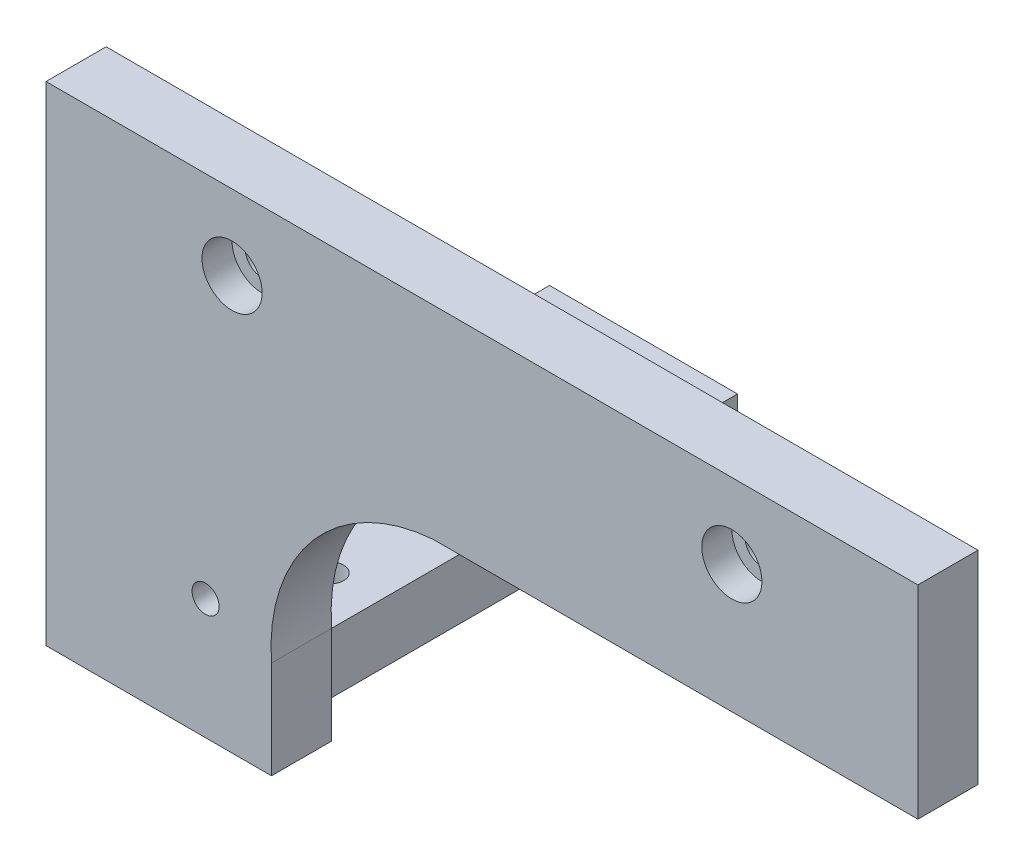
ISO-10303-21;
HEADER;
FILE_DESCRIPTION(('STEP AP214'),'2;1');
FILE_NAME('part.step','',(''),(''),'','','');
FILE_SCHEMA(('AUTOMOTIVE_DESIGN { 1 0 10303 214 1 1 1 1 }'));
ENDSEC;
DATA;
#1=APPLICATION_CONTEXT('core data for automotive mechanical design processes');
#2=APPLICATION_PROTOCOL_DEFINITION('international standard','automotive_design',2000,#1);
#3=PRODUCT_CONTEXT('',#1,'mechanical');
#4=PRODUCT('Part','Part','',(#3));
#5=PRODUCT_RELATED_PRODUCT_CATEGORY('part','',(#4));
#6=PRODUCT_DEFINITION_FORMATION('','',#4);
#7=PRODUCT_DEFINITION_CONTEXT('part definition',#1,'design');
#8=PRODUCT_DEFINITION('design','',#6,#7);
#9=PRODUCT_DEFINITION_SHAPE('','',#8);
#10=(LENGTH_UNIT() NAMED_UNIT(*) SI_UNIT(.MILLI.,.METRE.));
#11=(NAMED_UNIT(*) PLANE_ANGLE_UNIT() SI_UNIT($,.RADIAN.));
#12=(NAMED_UNIT(*) SI_UNIT($,.STERADIAN.) SOLID_ANGLE_UNIT());
#13=UNCERTAINTY_MEASURE_WITH_UNIT(LENGTH_MEASURE(1.E-05),#10,'distance_accuracy_value','');
#14=(GEOMETRIC_REPRESENTATION_CONTEXT(3) GLOBAL_UNCERTAINTY_ASSIGNED_CONTEXT((#13)) GLOBAL_UNIT_ASSIGNED_CONTEXT((#10,
#11,#12)) REPRESENTATION_CONTEXT('',''));
#15=CARTESIAN_POINT('',(0.,0.,0.));
#16=DIRECTION('',(0.,0.,1.));
#17=DIRECTION('',(1.,0.,0.));
#18=AXIS2_PLACEMENT_3D('',#15,#16,#17);
#19=CARTESIAN_POINT('',(33.25,3.5,0.));
#20=DIRECTION('',(0.,0.,1.));
#21=DIRECTION('',(1.,0.,0.));
#22=AXIS2_PLACEMENT_3D('',#19,#20,#21);
#23=CYLINDRICAL_SURFACE('',#22,2.25);
#24=CARTESIAN_POINT('',(33.25,3.5,0.));
#25=DIRECTION('',(0.,0.,1.));
#26=DIRECTION('',(1.,0.,0.));
#27=AXIS2_PLACEMENT_3D('',#24,#25,#26);
#28=CIRCLE('',#27,2.25);
#29=CARTESIAN_POINT('',(35.5,3.5,0.));
#30=VERTEX_POINT('',#29);
#31=EDGE_CURVE('E235',#30,#30,#28,.T.);
#32=ORIENTED_EDGE('',*,*,#31,.F.);
#33=EDGE_LOOP('',(#32));
#34=FACE_BOUND('',#33,.T.);
#35=CARTESIAN_POINT('',(33.25,3.5,4.));
#36=DIRECTION('',(0.,0.,1.));
#37=DIRECTION('',(1.,0.,0.));
#38=AXIS2_PLACEMENT_3D('',#35,#36,#37);
#39=CIRCLE('',#38,2.25);
#40=CARTESIAN_POINT('',(35.5,3.5,4.));
#41=VERTEX_POINT('',#40);
#42=EDGE_CURVE('E43',#41,#41,#39,.F.);
#43=ORIENTED_EDGE('',*,*,#42,.F.);
#44=EDGE_LOOP('',(#43));
#45=FACE_BOUND('',#44,.T.);
#46=ADVANCED_FACE('F39',(#34,#45),#23,.F.);
#47=CARTESIAN_POINT('',(-33.25,3.5,0.));
#48=DIRECTION('',(0.,0.,1.));
#49=DIRECTION('',(1.,0.,0.));
#50=AXIS2_PLACEMENT_3D('',#47,#48,#49);
#51=CYLINDRICAL_SURFACE('',#50,2.25);
#52=CARTESIAN_POINT('',(-33.25,3.5,0.));
#53=DIRECTION('',(0.,0.,1.));
#54=DIRECTION('',(1.,0.,0.));
#55=AXIS2_PLACEMENT_3D('',#52,#53,#54);
#56=CIRCLE('',#55,2.25);
#57=CARTESIAN_POINT('',(-31.,3.5,0.));
#58=VERTEX_POINT('',#57);
#59=EDGE_CURVE('E236',#58,#58,#56,.T.);
#60=ORIENTED_EDGE('',*,*,#59,.F.);
#61=EDGE_LOOP('',(#60));
#62=FACE_BOUND('',#61,.T.);
#63=CARTESIAN_POINT('',(-33.25,3.5,4.));
#64=DIRECTION('',(0.,0.,1.));
#65=DIRECTION('',(1.,0.,0.));
#66=AXIS2_PLACEMENT_3D('',#63,#64,#65);
#67=CIRCLE('',#66,2.25);
#68=CARTESIAN_POINT('',(-31.,3.5,4.));
#69=VERTEX_POINT('',#68);
#70=EDGE_CURVE('E160',#69,#69,#67,.F.);
#71=ORIENTED_EDGE('',*,*,#70,.F.);
#72=EDGE_LOOP('',(#71));
#73=FACE_BOUND('',#72,.T.);
#74=ADVANCED_FACE('F309',(#62,#73),#51,.F.);
#75=CARTESIAN_POINT('',(-58.,-43.5,8.));
#76=DIRECTION('',(0.,1.,0.));
#77=DIRECTION('',(0.,0.,1.));
#78=AXIS2_PLACEMENT_3D('',#75,#76,#77);
#79=PLANE('',#78);
#80=CARTESIAN_POINT('',(-28.244552345652,-43.5,-4.75544765434797));
#81=DIRECTION('',(0.,1.,0.));
#82=DIRECTION('',(0.,0.,-1.));
#83=AXIS2_PLACEMENT_3D('',#80,#81,#82);
#84=CIRCLE('',#83,4.76173164332131);
#85=CARTESIAN_POINT('',(-28.489104691304,-43.5,0.));
#86=VERTEX_POINT('',#85);
#87=CARTESIAN_POINT('',(-28.,-43.5,0.));
#88=VERTEX_POINT('',#87);
#89=EDGE_CURVE('E11',#86,#88,#84,.T.);
#90=ORIENTED_EDGE('',*,*,#89,.F.);
#91=DIRECTION('',(1.,0.,0.));
#92=VECTOR('',#91,1.);
#93=CARTESIAN_POINT('',(-58.,-43.5,0.));
#94=LINE('',#93,#92);
#95=EDGE_CURVE('E149',#86,#88,#94,.T.);
#96=ORIENTED_EDGE('',*,*,#95,.T.);
#97=EDGE_LOOP('',(#90,#96));
#98=FACE_BOUND('',#97,.T.);
#99=ADVANCED_FACE('F291',(#98),#79,.F.);
#100=CARTESIAN_POINT('',(-4.74999999999999,-36.75,8.));
#101=DIRECTION('',(0.,0.,1.));
#102=DIRECTION('',(1.,0.,0.));
#103=AXIS2_PLACEMENT_3D('',#100,#101,#102);
#104=PLANE('',#103);
#105=CARTESIAN_POINT('',(-33.25,3.5,8.));
#106=DIRECTION('',(0.,0.,1.));
#107=DIRECTION('',(1.,0.,0.));
#108=AXIS2_PLACEMENT_3D('',#105,#106,#107);
#109=CIRCLE('',#108,4.);
#110=CARTESIAN_POINT('',(-29.25,3.5,8.));
#111=VERTEX_POINT('',#110);
#112=EDGE_CURVE('E168',#111,#111,#109,.T.);
#113=ORIENTED_EDGE('',*,*,#112,.F.);
#114=EDGE_LOOP('',(#113));
#115=FACE_BOUND('',#114,.T.);
#116=CARTESIAN_POINT('',(33.25,3.5,8.));
#117=DIRECTION('',(0.,0.,1.));
#118=DIRECTION('',(1.,0.,0.));
#119=AXIS2_PLACEMENT_3D('',#116,#117,#118);
#120=CIRCLE('',#119,4.00000000000001);
#121=CARTESIAN_POINT('',(37.25,3.5,8.));
#122=VERTEX_POINT('',#121);
#123=EDGE_CURVE('E178',#122,#122,#120,.T.);
#124=ORIENTED_EDGE('',*,*,#123,.F.);
#125=EDGE_LOOP('',(#124));
#126=FACE_BOUND('',#125,.T.);
#127=DIRECTION('',(1.,0.,0.));
#128=VECTOR('',#127,1.);
#129=CARTESIAN_POINT('',(-6.50000000000001,-13.5,8.));
#130=LINE('',#129,#128);
#131=CARTESIAN_POINT('',(-6.5,-13.5,8.));
#132=VERTEX_POINT('',#131);
#133=CARTESIAN_POINT('',(58.,-13.5,8.));
#134=VERTEX_POINT('',#133);
#135=EDGE_CURVE('E156',#132,#134,#130,.T.);
#136=ORIENTED_EDGE('',*,*,#135,.T.);
#137=DIRECTION('',(0.,1.,0.));
#138=VECTOR('',#137,1.);
#139=CARTESIAN_POINT('',(58.,13.5,8.));
#140=LINE('',#139,#138);
#141=CARTESIAN_POINT('',(58.,13.5,8.));
#142=VERTEX_POINT('',#141);
#143=EDGE_CURVE('E99',#134,#142,#140,.T.);
#144=ORIENTED_EDGE('',*,*,#143,.T.);
#145=DIRECTION('',(-1.,0.,0.));
#146=VECTOR('',#145,1.);
#147=CARTESIAN_POINT('',(-58.,13.5,8.));
#148=LINE('',#147,#146);
#149=CARTESIAN_POINT('',(-58.,13.5,8.));
#150=VERTEX_POINT('',#149);
#151=EDGE_CURVE('E107',#142,#150,#148,.T.);
#152=ORIENTED_EDGE('',*,*,#151,.T.);
#153=DIRECTION('',(0.,-1.,0.));
#154=VECTOR('',#153,1.);
#155=CARTESIAN_POINT('',(-58.,13.5,8.));
#156=LINE('',#155,#154);
#157=CARTESIAN_POINT('',(-58.,-51.5,8.));
#158=VERTEX_POINT('',#157);
#159=EDGE_CURVE('E113',#150,#158,#156,.T.);
#160=ORIENTED_EDGE('',*,*,#159,.T.);
#161=DIRECTION('',(-1.,0.,0.));
#162=VECTOR('',#161,1.);
#163=CARTESIAN_POINT('',(-58.,-51.5,8.));
#164=LINE('',#163,#162);
#165=CARTESIAN_POINT('',(-28.,-51.5,8.));
#166=VERTEX_POINT('',#165);
#167=EDGE_CURVE('E212',#166,#158,#164,.T.);
#168=ORIENTED_EDGE('',*,*,#167,.F.);
#169=DIRECTION('',(0.,1.,0.));
#170=VECTOR('',#169,1.);
#171=CARTESIAN_POINT('',(-28.,-43.5,8.));
#172=LINE('',#171,#170);
#173=CARTESIAN_POINT('',(-28.,-38.5,8.));
#174=VERTEX_POINT('',#173);
#175=EDGE_CURVE('E133',#166,#174,#172,.T.);
#176=ORIENTED_EDGE('',*,*,#175,.T.);
#177=CARTESIAN_POINT('',(-4.74999999999999,-36.75,8.));
#178=DIRECTION('',(0.,0.,-1.));
#179=DIRECTION('',(1.,0.,0.));
#180=AXIS2_PLACEMENT_3D('',#177,#178,#179);
#181=CIRCLE('',#180,23.3157671973281);
#182=EDGE_CURVE('E63',#174,#132,#181,.T.);
#183=ORIENTED_EDGE('',*,*,#182,.T.);
#184=EDGE_LOOP('',(#136,#144,#152,#160,#168,#176,#183));
#185=FACE_BOUND('',#184,.T.);
#186=CARTESIAN_POINT('',(-36.7690984541548,-35.484363810152,8.));
#187=DIRECTION('',(0.,0.,1.));
#188=DIRECTION('',(1.,0.,0.));
#189=AXIS2_PLACEMENT_3D('',#186,#187,#188);
#190=CIRCLE('',#189,1.8);
#191=CARTESIAN_POINT('',(-34.9690984541548,-35.484363810152,8.));
#192=VERTEX_POINT('',#191);
#193=EDGE_CURVE('E144',#192,#192,#190,.T.);
#194=ORIENTED_EDGE('',*,*,#193,.F.);
#195=EDGE_LOOP('',(#194));
#196=FACE_BOUND('',#195,.T.);
#197=ADVANCED_FACE('F109',(#115,#126,#185,#196),#104,.T.);
#198=CARTESIAN_POINT('',(-4.74999999999999,-36.75,0.));
#199=DIRECTION('',(0.,0.,1.));
#200=DIRECTION('',(1.,0.,0.));
#201=AXIS2_PLACEMENT_3D('',#198,#199,#200);
#202=PLANE('',#201);
#203=ORIENTED_EDGE('',*,*,#59,.T.);
#204=EDGE_LOOP('',(#203));
#205=FACE_BOUND('',#204,.T.);
#206=ORIENTED_EDGE('',*,*,#31,.T.);
#207=EDGE_LOOP('',(#206));
#208=FACE_BOUND('',#207,.T.);
#209=DIRECTION('',(1.,0.,0.));
#210=VECTOR('',#209,1.);
#211=CARTESIAN_POINT('',(-6.50000000000001,-13.5,0.));
#212=LINE('',#211,#210);
#213=CARTESIAN_POINT('',(-6.5,-13.5,0.));
#214=VERTEX_POINT('',#213);
#215=CARTESIAN_POINT('',(58.,-13.5,0.));
#216=VERTEX_POINT('',#215);
#217=EDGE_CURVE('E140',#214,#216,#212,.T.);
#218=ORIENTED_EDGE('',*,*,#217,.F.);
#219=CARTESIAN_POINT('',(-4.74999999999999,-36.75,0.));
#220=DIRECTION('',(0.,0.,-1.));
#221=DIRECTION('',(1.,0.,0.));
#222=AXIS2_PLACEMENT_3D('',#219,#220,#221);
#223=CIRCLE('',#222,23.3157671973281);
#224=CARTESIAN_POINT('',(-28.,-38.5,0.));
#225=VERTEX_POINT('',#224);
#226=EDGE_CURVE('E90',#225,#214,#223,.T.);
#227=ORIENTED_EDGE('',*,*,#226,.F.);
#228=DIRECTION('',(0.,1.,0.));
#229=VECTOR('',#228,1.);
#230=CARTESIAN_POINT('',(-28.,-43.5,0.));
#231=LINE('',#230,#229);
#232=EDGE_CURVE('E153',#88,#225,#231,.T.);
#233=ORIENTED_EDGE('',*,*,#232,.F.);
#234=ORIENTED_EDGE('',*,*,#95,.F.);
#235=CARTESIAN_POINT('',(-58.,-43.5,0.));
#236=VERTEX_POINT('',#235);
#237=EDGE_CURVE('E150',#236,#86,#94,.T.);
#238=ORIENTED_EDGE('',*,*,#237,.F.);
#239=DIRECTION('',(0.,-1.,0.));
#240=VECTOR('',#239,1.);
#241=CARTESIAN_POINT('',(-58.,13.5,0.));
#242=LINE('',#241,#240);
#243=CARTESIAN_POINT('',(-58.,13.5,0.));
#244=VERTEX_POINT('',#243);
#245=EDGE_CURVE('E147',#244,#236,#242,.T.);
#246=ORIENTED_EDGE('',*,*,#245,.F.);
#247=DIRECTION('',(-1.,0.,0.));
#248=VECTOR('',#247,1.);
#249=CARTESIAN_POINT('',(-58.,13.5,0.));
#250=LINE('',#249,#248);
#251=CARTESIAN_POINT('',(58.,13.5,0.));
#252=VERTEX_POINT('',#251);
#253=EDGE_CURVE('E122',#252,#244,#250,.T.);
#254=ORIENTED_EDGE('',*,*,#253,.F.);
#255=DIRECTION('',(0.,1.,0.));
#256=VECTOR('',#255,1.);
#257=CARTESIAN_POINT('',(58.,13.5,0.));
#258=LINE('',#257,#256);
#259=EDGE_CURVE('E143',#216,#252,#258,.T.);
#260=ORIENTED_EDGE('',*,*,#259,.F.);
#261=EDGE_LOOP('',(#218,#227,#233,#234,#238,#246,#254,#260));
#262=FACE_BOUND('',#261,.T.);
#263=CARTESIAN_POINT('',(-36.7690984541548,-35.484363810152,0.));
#264=DIRECTION('',(0.,0.,1.));
#265=DIRECTION('',(1.,0.,0.));
#266=AXIS2_PLACEMENT_3D('',#263,#264,#265);
#267=CIRCLE('',#266,1.8);
#268=CARTESIAN_POINT('',(-34.9690984541548,-35.484363810152,0.));
#269=VERTEX_POINT('',#268);
#270=EDGE_CURVE('E239',#269,#269,#267,.T.);
#271=ORIENTED_EDGE('',*,*,#270,.T.);
#272=EDGE_LOOP('',(#271));
#273=FACE_BOUND('',#272,.T.);
#274=ADVANCED_FACE('F252',(#205,#208,#262,#273),#202,.F.);
#275=CARTESIAN_POINT('',(-6.50000000000001,-13.5,8.));
#276=DIRECTION('',(0.,1.,0.));
#277=DIRECTION('',(-1.,0.,0.));
#278=AXIS2_PLACEMENT_3D('',#275,#276,#277);
#279=PLANE('',#278);
#280=ORIENTED_EDGE('',*,*,#217,.T.);
#281=DIRECTION('',(0.,0.,-1.));
#282=VECTOR('',#281,1.);
#283=CARTESIAN_POINT('',(58.,-13.5,8.));
#284=LINE('',#283,#282);
#285=EDGE_CURVE('E48',#134,#216,#284,.T.);
#286=ORIENTED_EDGE('',*,*,#285,.F.);
#287=ORIENTED_EDGE('',*,*,#135,.F.);
#288=DIRECTION('',(0.,0.,-1.));
#289=VECTOR('',#288,1.);
#290=CARTESIAN_POINT('',(-6.5,-13.5,8.));
#291=LINE('',#290,#289);
#292=EDGE_CURVE('E139',#132,#214,#291,.T.);
#293=ORIENTED_EDGE('',*,*,#292,.T.);
#294=EDGE_LOOP('',(#280,#286,#287,#293));
#295=FACE_BOUND('',#294,.T.);
#296=ADVANCED_FACE('F41',(#295),#279,.F.);
#297=CARTESIAN_POINT('',(58.,13.5,8.));
#298=DIRECTION('',(-1.,0.,0.));
#299=DIRECTION('',(0.,-1.,0.));
#300=AXIS2_PLACEMENT_3D('',#297,#298,#299);
#301=PLANE('',#300);
#302=ORIENTED_EDGE('',*,*,#259,.T.);
#303=DIRECTION('',(0.,0.,-1.));
#304=VECTOR('',#303,1.);
#305=CARTESIAN_POINT('',(58.,13.5,8.));
#306=LINE('',#305,#304);
#307=EDGE_CURVE('E125',#142,#252,#306,.T.);
#308=ORIENTED_EDGE('',*,*,#307,.F.);
#309=ORIENTED_EDGE('',*,*,#143,.F.);
#310=ORIENTED_EDGE('',*,*,#285,.T.);
#311=EDGE_LOOP('',(#302,#308,#309,#310));
#312=FACE_BOUND('',#311,.T.);
#313=ADVANCED_FACE('F250',(#312),#301,.F.);
#314=CARTESIAN_POINT('',(-58.,13.5,8.));
#315=DIRECTION('',(0.,-1.,0.));
#316=DIRECTION('',(0.,0.,-1.));
#317=AXIS2_PLACEMENT_3D('',#314,#315,#316);
#318=PLANE('',#317);
#319=ORIENTED_EDGE('',*,*,#253,.T.);
#320=DIRECTION('',(0.,0.,-1.));
#321=VECTOR('',#320,1.);
#322=CARTESIAN_POINT('',(-58.,13.5,8.));
#323=LINE('',#322,#321);
#324=EDGE_CURVE('E119',#150,#244,#323,.T.);
#325=ORIENTED_EDGE('',*,*,#324,.F.);
#326=ORIENTED_EDGE('',*,*,#151,.F.);
#327=ORIENTED_EDGE('',*,*,#307,.T.);
#328=EDGE_LOOP('',(#319,#325,#326,#327));
#329=FACE_BOUND('',#328,.T.);
#330=ADVANCED_FACE('F120',(#329),#318,.F.);
#331=CARTESIAN_POINT('',(-58.,13.5,8.));
#332=DIRECTION('',(1.,0.,0.));
#333=DIRECTION('',(0.,1.,0.));
#334=AXIS2_PLACEMENT_3D('',#331,#332,#333);
#335=PLANE('',#334);
#336=ORIENTED_EDGE('',*,*,#245,.T.);
#337=DIRECTION('',(0.,0.,-1.));
#338=VECTOR('',#337,1.);
#339=CARTESIAN_POINT('',(-58.,-43.5,8.));
#340=LINE('',#339,#338);
#341=CARTESIAN_POINT('',(-58.,-43.5,-59.));
#342=VERTEX_POINT('',#341);
#343=EDGE_CURVE('E196',#236,#342,#340,.T.);
#344=ORIENTED_EDGE('',*,*,#343,.T.);
#345=DIRECTION('',(0.,1.,0.));
#346=VECTOR('',#345,1.);
#347=CARTESIAN_POINT('',(-58.,-51.5,-59.));
#348=LINE('',#347,#346);
#349=CARTESIAN_POINT('',(-58.,-51.5,-59.));
#350=VERTEX_POINT('',#349);
#351=EDGE_CURVE('E232',#350,#342,#348,.T.);
#352=ORIENTED_EDGE('',*,*,#351,.F.);
#353=DIRECTION('',(0.,0.,-1.));
#354=VECTOR('',#353,1.);
#355=CARTESIAN_POINT('',(-58.,-51.5,8.));
#356=LINE('',#355,#354);
#357=EDGE_CURVE('E132',#158,#350,#356,.T.);
#358=ORIENTED_EDGE('',*,*,#357,.F.);
#359=ORIENTED_EDGE('',*,*,#159,.F.);
#360=ORIENTED_EDGE('',*,*,#324,.T.);
#361=EDGE_LOOP('',(#336,#344,#352,#358,#359,#360));
#362=FACE_BOUND('',#361,.T.);
#363=ADVANCED_FACE('F129',(#362),#335,.F.);
#364=CARTESIAN_POINT('',(-28.,-43.5,8.));
#365=DIRECTION('',(-1.,0.,0.));
#366=DIRECTION('',(0.,0.,1.));
#367=AXIS2_PLACEMENT_3D('',#364,#365,#366);
#368=PLANE('',#367);
#369=ORIENTED_EDGE('',*,*,#232,.T.);
#370=DIRECTION('',(0.,0.,-1.));
#371=VECTOR('',#370,1.);
#372=CARTESIAN_POINT('',(-28.,-38.5,8.));
#373=LINE('',#372,#371);
#374=EDGE_CURVE('E126',#174,#225,#373,.T.);
#375=ORIENTED_EDGE('',*,*,#374,.F.);
#376=ORIENTED_EDGE('',*,*,#175,.F.);
#377=DIRECTION('',(0.,0.,1.));
#378=VECTOR('',#377,1.);
#379=CARTESIAN_POINT('',(-28.,-51.5,8.));
#380=LINE('',#379,#378);
#381=CARTESIAN_POINT('',(-28.,-51.5,0.));
#382=VERTEX_POINT('',#381);
#383=EDGE_CURVE('E209',#382,#166,#380,.T.);
#384=ORIENTED_EDGE('',*,*,#383,.F.);
#385=DIRECTION('',(0.,1.,0.));
#386=VECTOR('',#385,1.);
#387=CARTESIAN_POINT('',(-28.,-51.5,0.));
#388=LINE('',#387,#386);
#389=EDGE_CURVE('E214',#382,#88,#388,.T.);
#390=ORIENTED_EDGE('',*,*,#389,.T.);
#391=EDGE_LOOP('',(#369,#375,#376,#384,#390));
#392=FACE_BOUND('',#391,.T.);
#393=ADVANCED_FACE('F296',(#392),#368,.F.);
#394=CARTESIAN_POINT('',(-4.74999999999999,-36.75,8.));
#395=DIRECTION('',(0.,0.,-1.));
#396=DIRECTION('',(-1.,0.,0.));
#397=AXIS2_PLACEMENT_3D('',#394,#395,#396);
#398=CYLINDRICAL_SURFACE('',#397,23.3157671973281);
#399=ORIENTED_EDGE('',*,*,#226,.T.);
#400=ORIENTED_EDGE('',*,*,#292,.F.);
#401=ORIENTED_EDGE('',*,*,#182,.F.);
#402=ORIENTED_EDGE('',*,*,#374,.T.);
#403=EDGE_LOOP('',(#399,#400,#401,#402));
#404=FACE_BOUND('',#403,.T.);
#405=ADVANCED_FACE('F298',(#404),#398,.F.);
#406=CARTESIAN_POINT('',(-36.7690984541548,-35.484363810152,8.));
#407=DIRECTION('',(0.,0.,-1.));
#408=DIRECTION('',(-1.,0.,0.));
#409=AXIS2_PLACEMENT_3D('',#406,#407,#408);
#410=CYLINDRICAL_SURFACE('',#409,1.8);
#411=ORIENTED_EDGE('',*,*,#193,.T.);
#412=EDGE_LOOP('',(#411));
#413=FACE_BOUND('',#412,.T.);
#414=ORIENTED_EDGE('',*,*,#270,.F.);
#415=EDGE_LOOP('',(#414));
#416=FACE_BOUND('',#415,.T.);
#417=ADVANCED_FACE('F304',(#413,#416),#410,.F.);
#418=CARTESIAN_POINT('',(-28.244552345652,-43.5,-4.75544765434797));
#419=DIRECTION('',(0.,-1.,0.));
#420=DIRECTION('',(0.,0.,-1.));
#421=AXIS2_PLACEMENT_3D('',#418,#419,#420);
#422=PLANE('',#421);
#423=CARTESIAN_POINT('',(-39.4815325934559,-43.5,-11.2840641478726));
#424=DIRECTION('',(0.,-1.,0.));
#425=DIRECTION('',(0.,0.,-1.));
#426=AXIS2_PLACEMENT_3D('',#423,#424,#425);
#427=CIRCLE('',#426,1.8);
#428=CARTESIAN_POINT('',(-39.4815325934559,-43.5,-13.0840641478726));
#429=VERTEX_POINT('',#428);
#430=EDGE_CURVE('E183',#429,#429,#427,.T.);
#431=ORIENTED_EDGE('',*,*,#430,.T.);
#432=EDGE_LOOP('',(#431));
#433=FACE_BOUND('',#432,.T.);
#434=CARTESIAN_POINT('',(-39.6769850343786,-43.5,-44.8876876897744));
#435=DIRECTION('',(0.,-1.,0.));
#436=DIRECTION('',(0.,0.,-1.));
#437=AXIS2_PLACEMENT_3D('',#434,#435,#436);
#438=CIRCLE('',#437,1.8);
#439=CARTESIAN_POINT('',(-39.6769850343786,-43.5,-46.6876876897744));
#440=VERTEX_POINT('',#439);
#441=EDGE_CURVE('E190',#440,#440,#438,.T.);
#442=ORIENTED_EDGE('',*,*,#441,.T.);
#443=EDGE_LOOP('',(#442));
#444=FACE_BOUND('',#443,.T.);
#445=CARTESIAN_POINT('',(-49.6769850343786,-43.5,-44.8876876897744));
#446=DIRECTION('',(0.,-1.,0.));
#447=DIRECTION('',(0.,0.,-1.));
#448=AXIS2_PLACEMENT_3D('',#445,#446,#447);
#449=CIRCLE('',#448,1.8);
#450=CARTESIAN_POINT('',(-49.6769850343786,-43.5,-46.6876876897744));
#451=VERTEX_POINT('',#450);
#452=EDGE_CURVE('E186',#451,#451,#449,.T.);
#453=ORIENTED_EDGE('',*,*,#452,.T.);
#454=EDGE_LOOP('',(#453));
#455=FACE_BOUND('',#454,.T.);
#456=ORIENTED_EDGE('',*,*,#343,.F.);
#457=ORIENTED_EDGE('',*,*,#237,.T.);
#458=CARTESIAN_POINT('',(-33.,-43.5,-4.51089530869594));
#459=VERTEX_POINT('',#458);
#460=EDGE_CURVE('E50',#459,#86,#84,.T.);
#461=ORIENTED_EDGE('',*,*,#460,.F.);
#462=DIRECTION('',(0.,0.,1.));
#463=VECTOR('',#462,1.);
#464=CARTESIAN_POINT('',(-33.,-43.5,-59.));
#465=LINE('',#464,#463);
#466=CARTESIAN_POINT('',(-33.,-43.5,-59.));
#467=VERTEX_POINT('',#466);
#468=EDGE_CURVE('E220',#467,#459,#465,.T.);
#469=ORIENTED_EDGE('',*,*,#468,.F.);
#470=DIRECTION('',(1.,0.,0.));
#471=VECTOR('',#470,1.);
#472=CARTESIAN_POINT('',(-33.,-43.5,-59.));
#473=LINE('',#472,#471);
#474=EDGE_CURVE('E217',#342,#467,#473,.T.);
#475=ORIENTED_EDGE('',*,*,#474,.F.);
#476=EDGE_LOOP('',(#456,#457,#461,#469,#475));
#477=FACE_BOUND('',#476,.T.);
#478=ADVANCED_FACE('F263',(#433,#444,#455,#477),#422,.F.);
#479=CARTESIAN_POINT('',(-28.244552345652,-51.5,-4.75544765434797));
#480=DIRECTION('',(0.,-1.,0.));
#481=DIRECTION('',(0.,0.,-1.));
#482=AXIS2_PLACEMENT_3D('',#479,#480,#481);
#483=PLANE('',#482);
#484=CARTESIAN_POINT('',(-39.4815325934559,-51.5,-11.2840641478726));
#485=DIRECTION('',(0.,-1.,0.));
#486=DIRECTION('',(0.,0.,-1.));
#487=AXIS2_PLACEMENT_3D('',#484,#485,#486);
#488=CIRCLE('',#487,1.8);
#489=CARTESIAN_POINT('',(-39.4815325934559,-51.5,-13.0840641478726));
#490=VERTEX_POINT('',#489);
#491=EDGE_CURVE('E166',#490,#490,#488,.T.);
#492=ORIENTED_EDGE('',*,*,#491,.F.);
#493=EDGE_LOOP('',(#492));
#494=FACE_BOUND('',#493,.T.);
#495=CARTESIAN_POINT('',(-39.6769850343786,-51.5,-44.8876876897744));
#496=DIRECTION('',(0.,-1.,0.));
#497=DIRECTION('',(0.,0.,-1.));
#498=AXIS2_PLACEMENT_3D('',#495,#496,#497);
#499=CIRCLE('',#498,1.8);
#500=CARTESIAN_POINT('',(-39.6769850343786,-51.5,-46.6876876897744));
#501=VERTEX_POINT('',#500);
#502=EDGE_CURVE('E193',#501,#501,#499,.T.);
#503=ORIENTED_EDGE('',*,*,#502,.F.);
#504=EDGE_LOOP('',(#503));
#505=FACE_BOUND('',#504,.T.);
#506=ORIENTED_EDGE('',*,*,#357,.T.);
#507=DIRECTION('',(1.,0.,0.));
#508=VECTOR('',#507,1.);
#509=CARTESIAN_POINT('',(-33.,-51.5,-59.));
#510=LINE('',#509,#508);
#511=CARTESIAN_POINT('',(-33.,-51.5,-59.));
#512=VERTEX_POINT('',#511);
#513=EDGE_CURVE('E200',#350,#512,#510,.T.);
#514=ORIENTED_EDGE('',*,*,#513,.T.);
#515=DIRECTION('',(0.,0.,1.));
#516=VECTOR('',#515,1.);
#517=CARTESIAN_POINT('',(-33.,-51.5,-59.));
#518=LINE('',#517,#516);
#519=CARTESIAN_POINT('',(-33.,-51.5,-4.51089530869594));
#520=VERTEX_POINT('',#519);
#521=EDGE_CURVE('E203',#512,#520,#518,.T.);
#522=ORIENTED_EDGE('',*,*,#521,.T.);
#523=CARTESIAN_POINT('',(-28.244552345652,-51.5,-4.75544765434797));
#524=DIRECTION('',(0.,1.,0.));
#525=DIRECTION('',(0.,0.,-1.));
#526=AXIS2_PLACEMENT_3D('',#523,#524,#525);
#527=CIRCLE('',#526,4.76173164332131);
#528=EDGE_CURVE('E206',#520,#382,#527,.T.);
#529=ORIENTED_EDGE('',*,*,#528,.T.);
#530=ORIENTED_EDGE('',*,*,#383,.T.);
#531=ORIENTED_EDGE('',*,*,#167,.T.);
#532=EDGE_LOOP('',(#506,#514,#522,#529,#530,#531));
#533=FACE_BOUND('',#532,.T.);
#534=CARTESIAN_POINT('',(-49.6769850343786,-51.5,-44.8876876897744));
#535=DIRECTION('',(0.,-1.,0.));
#536=DIRECTION('',(0.,0.,-1.));
#537=AXIS2_PLACEMENT_3D('',#534,#535,#536);
#538=CIRCLE('',#537,1.8);
#539=CARTESIAN_POINT('',(-49.6769850343786,-51.5,-46.6876876897744));
#540=VERTEX_POINT('',#539);
#541=EDGE_CURVE('E187',#540,#540,#538,.T.);
#542=ORIENTED_EDGE('',*,*,#541,.F.);
#543=EDGE_LOOP('',(#542));
#544=FACE_BOUND('',#543,.T.);
#545=ADVANCED_FACE('F273',(#494,#505,#533,#544),#483,.T.);
#546=CARTESIAN_POINT('',(-33.,-51.5,-59.));
#547=DIRECTION('',(0.,0.,1.));
#548=DIRECTION('',(1.,0.,0.));
#549=AXIS2_PLACEMENT_3D('',#546,#547,#548);
#550=PLANE('',#549);
#551=ORIENTED_EDGE('',*,*,#474,.T.);
#552=DIRECTION('',(0.,1.,0.));
#553=VECTOR('',#552,1.);
#554=CARTESIAN_POINT('',(-33.,-51.5,-59.));
#555=LINE('',#554,#553);
#556=EDGE_CURVE('E229',#512,#467,#555,.T.);
#557=ORIENTED_EDGE('',*,*,#556,.F.);
#558=ORIENTED_EDGE('',*,*,#513,.F.);
#559=ORIENTED_EDGE('',*,*,#351,.T.);
#560=EDGE_LOOP('',(#551,#557,#558,#559));
#561=FACE_BOUND('',#560,.T.);
#562=ADVANCED_FACE('F268',(#561),#550,.F.);
#563=CARTESIAN_POINT('',(-33.,-51.5,-59.));
#564=DIRECTION('',(-1.,0.,0.));
#565=DIRECTION('',(0.,0.,1.));
#566=AXIS2_PLACEMENT_3D('',#563,#564,#565);
#567=PLANE('',#566);
#568=ORIENTED_EDGE('',*,*,#468,.T.);
#569=DIRECTION('',(0.,1.,0.));
#570=VECTOR('',#569,1.);
#571=CARTESIAN_POINT('',(-33.,-51.5,-4.51089530869594));
#572=LINE('',#571,#570);
#573=EDGE_CURVE('E226',#520,#459,#572,.T.);
#574=ORIENTED_EDGE('',*,*,#573,.F.);
#575=ORIENTED_EDGE('',*,*,#521,.F.);
#576=ORIENTED_EDGE('',*,*,#556,.T.);
#577=EDGE_LOOP('',(#568,#574,#575,#576));
#578=FACE_BOUND('',#577,.T.);
#579=ADVANCED_FACE('F423',(#578),#567,.F.);
#580=CARTESIAN_POINT('',(-28.244552345652,-51.5,-4.75544765434797));
#581=DIRECTION('',(0.,1.,0.));
#582=DIRECTION('',(0.,0.,1.));
#583=AXIS2_PLACEMENT_3D('',#580,#581,#582);
#584=CYLINDRICAL_SURFACE('',#583,4.76173164332131);
#585=ORIENTED_EDGE('',*,*,#460,.T.);
#586=ORIENTED_EDGE('',*,*,#89,.T.);
#587=ORIENTED_EDGE('',*,*,#389,.F.);
#588=ORIENTED_EDGE('',*,*,#528,.F.);
#589=ORIENTED_EDGE('',*,*,#573,.T.);
#590=EDGE_LOOP('',(#585,#586,#587,#588,#589));
#591=FACE_BOUND('',#590,.T.);
#592=ADVANCED_FACE('F294',(#591),#584,.F.);
#593=CARTESIAN_POINT('',(-39.6769850343786,-51.5,-44.8876876897744));
#594=DIRECTION('',(0.,1.,0.));
#595=DIRECTION('',(0.,0.,1.));
#596=AXIS2_PLACEMENT_3D('',#593,#594,#595);
#597=CYLINDRICAL_SURFACE('',#596,1.8);
#598=ORIENTED_EDGE('',*,*,#502,.T.);
#599=EDGE_LOOP('',(#598));
#600=FACE_BOUND('',#599,.T.);
#601=ORIENTED_EDGE('',*,*,#441,.F.);
#602=EDGE_LOOP('',(#601));
#603=FACE_BOUND('',#602,.T.);
#604=ADVANCED_FACE('F410',(#600,#603),#597,.F.);
#605=CARTESIAN_POINT('',(-49.6769850343786,-51.5,-44.8876876897744));
#606=DIRECTION('',(0.,1.,0.));
#607=DIRECTION('',(0.,0.,1.));
#608=AXIS2_PLACEMENT_3D('',#605,#606,#607);
#609=CYLINDRICAL_SURFACE('',#608,1.8);
#610=ORIENTED_EDGE('',*,*,#541,.T.);
#611=EDGE_LOOP('',(#610));
#612=FACE_BOUND('',#611,.T.);
#613=ORIENTED_EDGE('',*,*,#452,.F.);
#614=EDGE_LOOP('',(#613));
#615=FACE_BOUND('',#614,.T.);
#616=ADVANCED_FACE('F406',(#612,#615),#609,.F.);
#617=CARTESIAN_POINT('',(-39.4815325934559,-41.5,-11.2840641478726));
#618=DIRECTION('',(0.,-1.,0.));
#619=DIRECTION('',(0.,0.,-1.));
#620=AXIS2_PLACEMENT_3D('',#617,#618,#619);
#621=CYLINDRICAL_SURFACE('',#620,1.8);
#622=ORIENTED_EDGE('',*,*,#491,.T.);
#623=EDGE_LOOP('',(#622));
#624=FACE_BOUND('',#623,.T.);
#625=ORIENTED_EDGE('',*,*,#430,.F.);
#626=EDGE_LOOP('',(#625));
#627=FACE_BOUND('',#626,.T.);
#628=ADVANCED_FACE('F367',(#624,#627),#621,.F.);
#629=CARTESIAN_POINT('',(-33.25,3.5,4.));
#630=DIRECTION('',(0.,0.,1.));
#631=DIRECTION('',(1.,0.,0.));
#632=AXIS2_PLACEMENT_3D('',#629,#630,#631);
#633=PLANE('',#632);
#634=CARTESIAN_POINT('',(-33.25,3.5,4.));
#635=DIRECTION('',(0.,0.,1.));
#636=DIRECTION('',(1.,0.,0.));
#637=AXIS2_PLACEMENT_3D('',#634,#635,#636);
#638=CIRCLE('',#637,4.);
#639=CARTESIAN_POINT('',(-29.25,3.5,4.));
#640=VERTEX_POINT('',#639);
#641=EDGE_CURVE('E162',#640,#640,#638,.T.);
#642=ORIENTED_EDGE('',*,*,#641,.T.);
#643=EDGE_LOOP('',(#642));
#644=FACE_BOUND('',#643,.T.);
#645=ORIENTED_EDGE('',*,*,#70,.T.);
#646=EDGE_LOOP('',(#645));
#647=FACE_BOUND('',#646,.T.);
#648=ADVANCED_FACE('F361',(#644,#647),#633,.T.);
#649=CARTESIAN_POINT('',(-33.25,3.5,4.));
#650=DIRECTION('',(0.,0.,1.));
#651=DIRECTION('',(1.,0.,0.));
#652=AXIS2_PLACEMENT_3D('',#649,#650,#651);
#653=CYLINDRICAL_SURFACE('',#652,4.);
#654=ORIENTED_EDGE('',*,*,#641,.F.);
#655=EDGE_LOOP('',(#654));
#656=FACE_BOUND('',#655,.T.);
#657=ORIENTED_EDGE('',*,*,#112,.T.);
#658=EDGE_LOOP('',(#657));
#659=FACE_BOUND('',#658,.T.);
#660=ADVANCED_FACE('F366',(#656,#659),#653,.F.);
#661=CARTESIAN_POINT('',(33.25,3.5,4.));
#662=DIRECTION('',(0.,0.,1.));
#663=DIRECTION('',(1.,0.,0.));
#664=AXIS2_PLACEMENT_3D('',#661,#662,#663);
#665=PLANE('',#664);
#666=CARTESIAN_POINT('',(33.25,3.5,4.));
#667=DIRECTION('',(0.,0.,1.));
#668=DIRECTION('',(1.,0.,0.));
#669=AXIS2_PLACEMENT_3D('',#666,#667,#668);
#670=CIRCLE('',#669,4.00000000000001);
#671=CARTESIAN_POINT('',(37.25,3.5,4.));
#672=VERTEX_POINT('',#671);
#673=EDGE_CURVE('E173',#672,#672,#670,.T.);
#674=ORIENTED_EDGE('',*,*,#673,.T.);
#675=EDGE_LOOP('',(#674));
#676=FACE_BOUND('',#675,.T.);
#677=ORIENTED_EDGE('',*,*,#42,.T.);
#678=EDGE_LOOP('',(#677));
#679=FACE_BOUND('',#678,.T.);
#680=ADVANCED_FACE('F378',(#676,#679),#665,.T.);
#681=CARTESIAN_POINT('',(33.25,3.5,4.));
#682=DIRECTION('',(0.,0.,1.));
#683=DIRECTION('',(1.,0.,0.));
#684=AXIS2_PLACEMENT_3D('',#681,#682,#683);
#685=CYLINDRICAL_SURFACE('',#684,4.00000000000001);
#686=ORIENTED_EDGE('',*,*,#673,.F.);
#687=EDGE_LOOP('',(#686));
#688=FACE_BOUND('',#687,.T.);
#689=ORIENTED_EDGE('',*,*,#123,.T.);
#690=EDGE_LOOP('',(#689));
#691=FACE_BOUND('',#690,.T.);
#692=ADVANCED_FACE('F388',(#688,#691),#685,.F.);
#693=CLOSED_SHELL('',(#46,#74,#99,#197,#274,#296,#313,#330,#363,#393,#405,#417,#478,#545,#562,
#579,#592,#604,#616,#628,#648,#660,#680,#692));
#694=MANIFOLD_SOLID_BREP('B2',#693);
#695=ADVANCED_BREP_SHAPE_REPRESENTATION('',(#18,#694),#14);
#696=SHAPE_DEFINITION_REPRESENTATION(#9,#695);
ENDSEC;
END-ISO-10303-21;
